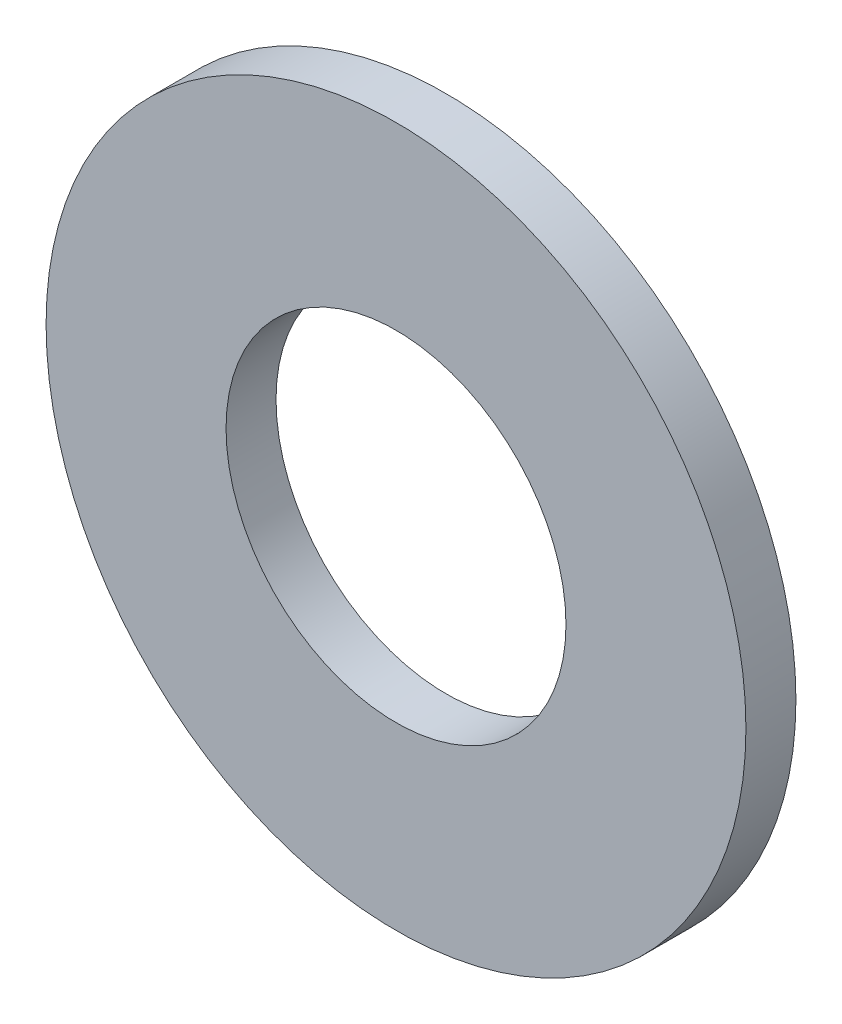
ISO-10303-21;
HEADER;
FILE_DESCRIPTION(('STEP AP214'),'2;1');
FILE_NAME('part.step','',(''),(''),'','','');
FILE_SCHEMA(('AUTOMOTIVE_DESIGN { 1 0 10303 214 1 1 1 1 }'));
ENDSEC;
DATA;
#1=APPLICATION_CONTEXT('core data for automotive mechanical design processes');
#2=APPLICATION_PROTOCOL_DEFINITION('international standard','automotive_design',2000,#1);
#3=PRODUCT_CONTEXT('',#1,'mechanical');
#4=PRODUCT('Part','Part','',(#3));
#5=PRODUCT_RELATED_PRODUCT_CATEGORY('part','',(#4));
#6=PRODUCT_DEFINITION_FORMATION('','',#4);
#7=PRODUCT_DEFINITION_CONTEXT('part definition',#1,'design');
#8=PRODUCT_DEFINITION('design','',#6,#7);
#9=PRODUCT_DEFINITION_SHAPE('','',#8);
#10=(LENGTH_UNIT() NAMED_UNIT(*) SI_UNIT(.MILLI.,.METRE.));
#11=(NAMED_UNIT(*) PLANE_ANGLE_UNIT() SI_UNIT($,.RADIAN.));
#12=(NAMED_UNIT(*) SI_UNIT($,.STERADIAN.) SOLID_ANGLE_UNIT());
#13=UNCERTAINTY_MEASURE_WITH_UNIT(LENGTH_MEASURE(1.E-05),#10,'distance_accuracy_value','');
#14=(GEOMETRIC_REPRESENTATION_CONTEXT(3) GLOBAL_UNCERTAINTY_ASSIGNED_CONTEXT((#13)) GLOBAL_UNIT_ASSIGNED_CONTEXT((#10,
#11,#12)) REPRESENTATION_CONTEXT('',''));
#15=CARTESIAN_POINT('',(0.,0.,0.));
#16=DIRECTION('',(0.,0.,1.));
#17=DIRECTION('',(1.,0.,0.));
#18=AXIS2_PLACEMENT_3D('',#15,#16,#17);
#19=CARTESIAN_POINT('',(0.,0.,0.25));
#20=DIRECTION('',(0.,0.,1.));
#21=DIRECTION('',(1.,0.,0.));
#22=AXIS2_PLACEMENT_3D('',#19,#20,#21);
#23=PLANE('',#22);
#24=CARTESIAN_POINT('',(0.,0.,0.25));
#25=DIRECTION('',(0.,0.,1.));
#26=DIRECTION('',(1.,0.,0.));
#27=AXIS2_PLACEMENT_3D('',#24,#25,#26);
#28=CIRCLE('',#27,3.5);
#29=CARTESIAN_POINT('',(3.5,0.,0.25));
#30=VERTEX_POINT('',#29);
#31=EDGE_CURVE('E10',#30,#30,#28,.T.);
#32=ORIENTED_EDGE('',*,*,#31,.T.);
#33=EDGE_LOOP('',(#32));
#34=FACE_BOUND('',#33,.T.);
#35=CARTESIAN_POINT('',(0.,0.,0.25));
#36=DIRECTION('',(0.,0.,1.));
#37=DIRECTION('',(1.,0.,0.));
#38=AXIS2_PLACEMENT_3D('',#35,#36,#37);
#39=CIRCLE('',#38,1.7);
#40=CARTESIAN_POINT('',(1.7,0.,0.25));
#41=VERTEX_POINT('',#40);
#42=EDGE_CURVE('E42',#41,#41,#39,.T.);
#43=ORIENTED_EDGE('',*,*,#42,.F.);
#44=EDGE_LOOP('',(#43));
#45=FACE_BOUND('',#44,.T.);
#46=ADVANCED_FACE('F31',(#34,#45),#23,.T.);
#47=CARTESIAN_POINT('',(0.,0.,-0.25));
#48=DIRECTION('',(0.,0.,1.));
#49=DIRECTION('',(1.,0.,0.));
#50=AXIS2_PLACEMENT_3D('',#47,#48,#49);
#51=PLANE('',#50);
#52=CARTESIAN_POINT('',(0.,0.,-0.25));
#53=DIRECTION('',(0.,0.,1.));
#54=DIRECTION('',(1.,0.,0.));
#55=AXIS2_PLACEMENT_3D('',#52,#53,#54);
#56=CIRCLE('',#55,3.5);
#57=CARTESIAN_POINT('',(3.5,0.,-0.25));
#58=VERTEX_POINT('',#57);
#59=EDGE_CURVE('E35',#58,#58,#56,.T.);
#60=ORIENTED_EDGE('',*,*,#59,.F.);
#61=EDGE_LOOP('',(#60));
#62=FACE_BOUND('',#61,.T.);
#63=CARTESIAN_POINT('',(0.,0.,-0.25));
#64=DIRECTION('',(0.,0.,1.));
#65=DIRECTION('',(1.,0.,0.));
#66=AXIS2_PLACEMENT_3D('',#63,#64,#65);
#67=CIRCLE('',#66,1.7);
#68=CARTESIAN_POINT('',(1.7,0.,-0.25));
#69=VERTEX_POINT('',#68);
#70=EDGE_CURVE('E44',#69,#69,#67,.T.);
#71=ORIENTED_EDGE('',*,*,#70,.T.);
#72=EDGE_LOOP('',(#71));
#73=FACE_BOUND('',#72,.T.);
#74=ADVANCED_FACE('F54',(#62,#73),#51,.F.);
#75=CARTESIAN_POINT('',(0.,0.,0.25));
#76=DIRECTION('',(0.,0.,-1.));
#77=DIRECTION('',(-1.,0.,0.));
#78=AXIS2_PLACEMENT_3D('',#75,#76,#77);
#79=CYLINDRICAL_SURFACE('',#78,3.5);
#80=ORIENTED_EDGE('',*,*,#31,.F.);
#81=EDGE_LOOP('',(#80));
#82=FACE_BOUND('',#81,.T.);
#83=ORIENTED_EDGE('',*,*,#59,.T.);
#84=EDGE_LOOP('',(#83));
#85=FACE_BOUND('',#84,.T.);
#86=ADVANCED_FACE('F33',(#82,#85),#79,.T.);
#87=CARTESIAN_POINT('',(0.,0.,0.25));
#88=DIRECTION('',(0.,0.,-1.));
#89=DIRECTION('',(-1.,0.,0.));
#90=AXIS2_PLACEMENT_3D('',#87,#88,#89);
#91=CYLINDRICAL_SURFACE('',#90,1.7);
#92=ORIENTED_EDGE('',*,*,#42,.T.);
#93=EDGE_LOOP('',(#92));
#94=FACE_BOUND('',#93,.T.);
#95=ORIENTED_EDGE('',*,*,#70,.F.);
#96=EDGE_LOOP('',(#95));
#97=FACE_BOUND('',#96,.T.);
#98=ADVANCED_FACE('F50',(#94,#97),#91,.F.);
#99=CLOSED_SHELL('',(#46,#74,#86,#98));
#100=MANIFOLD_SOLID_BREP('B2',#99);
#101=ADVANCED_BREP_SHAPE_REPRESENTATION('',(#18,#100),#14);
#102=SHAPE_DEFINITION_REPRESENTATION(#9,#101);
ENDSEC;
END-ISO-10303-21;
